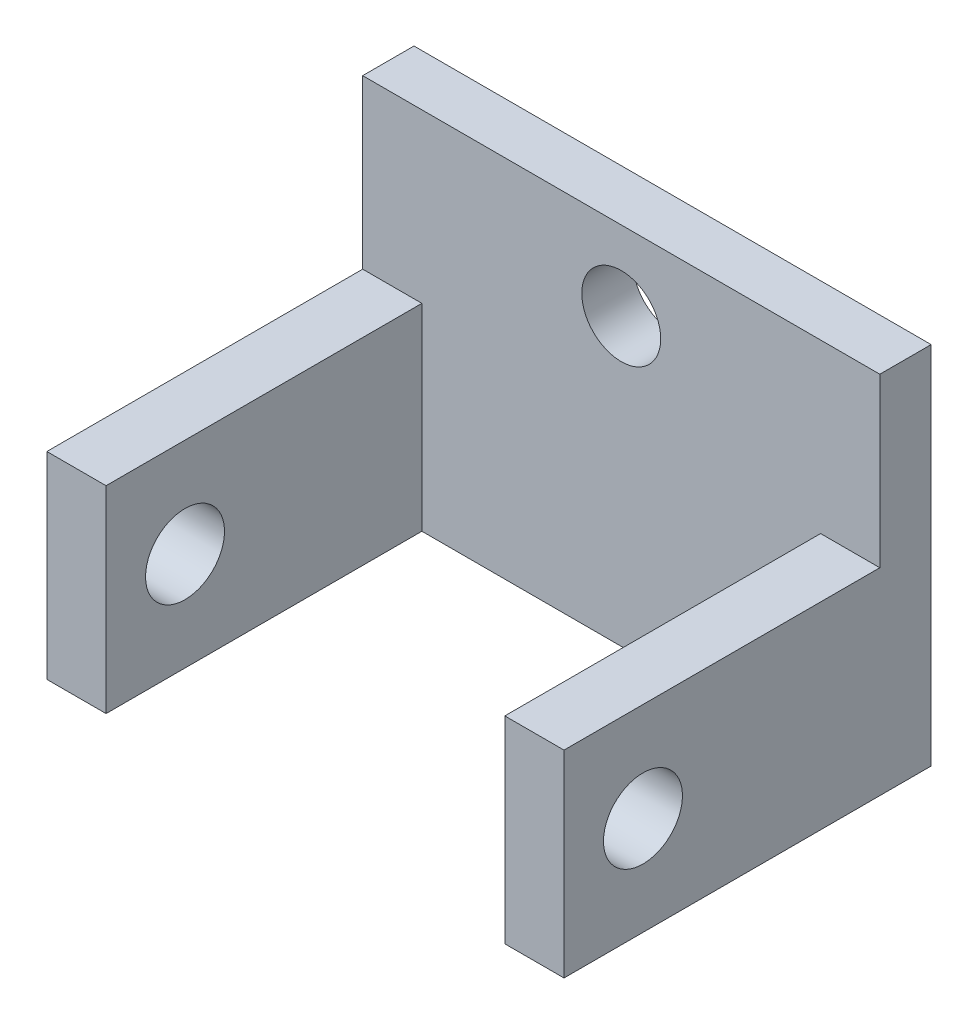
ISO-10303-21;
HEADER;
FILE_DESCRIPTION(('STEP AP214'),'2;1');
FILE_NAME('part.step','',(''),(''),'','','');
FILE_SCHEMA(('AUTOMOTIVE_DESIGN { 1 0 10303 214 1 1 1 1 }'));
ENDSEC;
DATA;
#1=APPLICATION_CONTEXT('core data for automotive mechanical design processes');
#2=APPLICATION_PROTOCOL_DEFINITION('international standard','automotive_design',2000,#1);
#3=PRODUCT_CONTEXT('',#1,'mechanical');
#4=PRODUCT('Part','Part','',(#3));
#5=PRODUCT_RELATED_PRODUCT_CATEGORY('part','',(#4));
#6=PRODUCT_DEFINITION_FORMATION('','',#4);
#7=PRODUCT_DEFINITION_CONTEXT('part definition',#1,'design');
#8=PRODUCT_DEFINITION('design','',#6,#7);
#9=PRODUCT_DEFINITION_SHAPE('','',#8);
#10=(LENGTH_UNIT() NAMED_UNIT(*) SI_UNIT(.MILLI.,.METRE.));
#11=(NAMED_UNIT(*) PLANE_ANGLE_UNIT() SI_UNIT($,.RADIAN.));
#12=(NAMED_UNIT(*) SI_UNIT($,.STERADIAN.) SOLID_ANGLE_UNIT());
#13=UNCERTAINTY_MEASURE_WITH_UNIT(LENGTH_MEASURE(1.E-05),#10,'distance_accuracy_value','');
#14=(GEOMETRIC_REPRESENTATION_CONTEXT(3) GLOBAL_UNCERTAINTY_ASSIGNED_CONTEXT((#13)) GLOBAL_UNIT_ASSIGNED_CONTEXT((#10,
#11,#12)) REPRESENTATION_CONTEXT('',''));
#15=CARTESIAN_POINT('',(0.,0.,0.));
#16=DIRECTION('',(0.,0.,1.));
#17=DIRECTION('',(1.,0.,0.));
#18=AXIS2_PLACEMENT_3D('',#15,#16,#17);
#19=CARTESIAN_POINT('',(0.,0.,1.3));
#20=DIRECTION('',(0.,0.,-1.));
#21=DIRECTION('',(-1.,0.,0.));
#22=AXIS2_PLACEMENT_3D('',#19,#20,#21);
#23=PLANE('',#22);
#24=CARTESIAN_POINT('',(6.55,7.24557974079687,1.3));
#25=DIRECTION('',(0.,0.,1.));
#26=DIRECTION('',(1.,0.,0.));
#27=AXIS2_PLACEMENT_3D('',#24,#25,#26);
#28=CIRCLE('',#27,1.);
#29=CARTESIAN_POINT('',(7.55,7.24557974079687,1.3));
#30=VERTEX_POINT('',#29);
#31=EDGE_CURVE('E183',#30,#30,#28,.T.);
#32=ORIENTED_EDGE('',*,*,#31,.F.);
#33=EDGE_LOOP('',(#32));
#34=FACE_BOUND('',#33,.T.);
#35=DIRECTION('',(-1.,0.,0.));
#36=VECTOR('',#35,1.);
#37=CARTESIAN_POINT('',(13.1,5.,1.3));
#38=LINE('',#37,#36);
#39=CARTESIAN_POINT('',(13.1,5.,1.3));
#40=VERTEX_POINT('',#39);
#41=CARTESIAN_POINT('',(11.6,5.,1.3));
#42=VERTEX_POINT('',#41);
#43=EDGE_CURVE('E256',#40,#42,#38,.T.);
#44=ORIENTED_EDGE('',*,*,#43,.F.);
#45=DIRECTION('',(0.,1.,0.));
#46=VECTOR('',#45,1.);
#47=CARTESIAN_POINT('',(13.1,0.,1.3));
#48=LINE('',#47,#46);
#49=CARTESIAN_POINT('',(13.1,9.24557974079687,1.3));
#50=VERTEX_POINT('',#49);
#51=EDGE_CURVE('E141',#40,#50,#48,.T.);
#52=ORIENTED_EDGE('',*,*,#51,.T.);
#53=DIRECTION('',(-1.,0.,0.));
#54=VECTOR('',#53,1.);
#55=CARTESIAN_POINT('',(0.,9.24557974079687,1.3));
#56=LINE('',#55,#54);
#57=CARTESIAN_POINT('',(0.,9.24557974079687,1.3));
#58=VERTEX_POINT('',#57);
#59=EDGE_CURVE('E199',#50,#58,#56,.T.);
#60=ORIENTED_EDGE('',*,*,#59,.T.);
#61=DIRECTION('',(0.,-1.,0.));
#62=VECTOR('',#61,1.);
#63=CARTESIAN_POINT('',(0.,0.,1.3));
#64=LINE('',#63,#62);
#65=CARTESIAN_POINT('',(0.,5.,1.3));
#66=VERTEX_POINT('',#65);
#67=EDGE_CURVE('E191',#58,#66,#64,.T.);
#68=ORIENTED_EDGE('',*,*,#67,.T.);
#69=DIRECTION('',(-1.,0.,0.));
#70=VECTOR('',#69,1.);
#71=CARTESIAN_POINT('',(0.,5.,1.3));
#72=LINE('',#71,#70);
#73=CARTESIAN_POINT('',(1.5,5.,1.3));
#74=VERTEX_POINT('',#73);
#75=EDGE_CURVE('E148',#74,#66,#72,.T.);
#76=ORIENTED_EDGE('',*,*,#75,.F.);
#77=DIRECTION('',(0.,1.,0.));
#78=VECTOR('',#77,1.);
#79=CARTESIAN_POINT('',(1.5,5.,1.3));
#80=LINE('',#79,#78);
#81=CARTESIAN_POINT('',(1.5,0.,1.3));
#82=VERTEX_POINT('',#81);
#83=EDGE_CURVE('E143',#82,#74,#80,.T.);
#84=ORIENTED_EDGE('',*,*,#83,.F.);
#85=DIRECTION('',(1.,0.,0.));
#86=VECTOR('',#85,1.);
#87=CARTESIAN_POINT('',(0.,0.,1.3));
#88=LINE('',#87,#86);
#89=CARTESIAN_POINT('',(11.6,0.,1.3));
#90=VERTEX_POINT('',#89);
#91=EDGE_CURVE('E61',#82,#90,#88,.T.);
#92=ORIENTED_EDGE('',*,*,#91,.T.);
#93=DIRECTION('',(0.,-1.,0.));
#94=VECTOR('',#93,1.);
#95=CARTESIAN_POINT('',(11.6,5.,1.3));
#96=LINE('',#95,#94);
#97=EDGE_CURVE('E56',#42,#90,#96,.T.);
#98=ORIENTED_EDGE('',*,*,#97,.F.);
#99=EDGE_LOOP('',(#44,#52,#60,#68,#76,#84,#92,#98));
#100=FACE_BOUND('',#99,.T.);
#101=ADVANCED_FACE('F39',(#34,#100),#23,.F.);
#102=CARTESIAN_POINT('',(0.,0.,0.));
#103=DIRECTION('',(0.,0.,-1.));
#104=DIRECTION('',(-1.,0.,0.));
#105=AXIS2_PLACEMENT_3D('',#102,#103,#104);
#106=PLANE('',#105);
#107=DIRECTION('',(0.,-1.,0.));
#108=VECTOR('',#107,1.);
#109=CARTESIAN_POINT('',(0.,0.,0.));
#110=LINE('',#109,#108);
#111=CARTESIAN_POINT('',(0.,9.24557974079687,0.));
#112=VERTEX_POINT('',#111);
#113=CARTESIAN_POINT('',(0.,0.,0.));
#114=VERTEX_POINT('',#113);
#115=EDGE_CURVE('E187',#112,#114,#110,.T.);
#116=ORIENTED_EDGE('',*,*,#115,.F.);
#117=DIRECTION('',(-1.,0.,0.));
#118=VECTOR('',#117,1.);
#119=CARTESIAN_POINT('',(0.,9.24557974079687,0.));
#120=LINE('',#119,#118);
#121=CARTESIAN_POINT('',(13.1,9.24557974079687,0.));
#122=VERTEX_POINT('',#121);
#123=EDGE_CURVE('E194',#122,#112,#120,.T.);
#124=ORIENTED_EDGE('',*,*,#123,.F.);
#125=DIRECTION('',(0.,1.,0.));
#126=VECTOR('',#125,1.);
#127=CARTESIAN_POINT('',(13.1,0.,0.));
#128=LINE('',#127,#126);
#129=CARTESIAN_POINT('',(13.1,0.,0.));
#130=VERTEX_POINT('',#129);
#131=EDGE_CURVE('E209',#130,#122,#128,.T.);
#132=ORIENTED_EDGE('',*,*,#131,.F.);
#133=DIRECTION('',(1.,0.,0.));
#134=VECTOR('',#133,1.);
#135=CARTESIAN_POINT('',(0.,0.,0.));
#136=LINE('',#135,#134);
#137=EDGE_CURVE('E206',#114,#130,#136,.T.);
#138=ORIENTED_EDGE('',*,*,#137,.F.);
#139=EDGE_LOOP('',(#116,#124,#132,#138));
#140=FACE_BOUND('',#139,.T.);
#141=CARTESIAN_POINT('',(6.55,7.24557974079687,0.));
#142=DIRECTION('',(0.,0.,1.));
#143=DIRECTION('',(1.,0.,0.));
#144=AXIS2_PLACEMENT_3D('',#141,#142,#143);
#145=CIRCLE('',#144,1.);
#146=CARTESIAN_POINT('',(7.55,7.24557974079687,0.));
#147=VERTEX_POINT('',#146);
#148=EDGE_CURVE('E182',#147,#147,#145,.T.);
#149=ORIENTED_EDGE('',*,*,#148,.T.);
#150=EDGE_LOOP('',(#149));
#151=FACE_BOUND('',#150,.T.);
#152=ADVANCED_FACE('F227',(#140,#151),#106,.T.);
#153=CARTESIAN_POINT('',(0.,0.,1.3));
#154=DIRECTION('',(1.,0.,0.));
#155=DIRECTION('',(0.,0.,-1.));
#156=AXIS2_PLACEMENT_3D('',#153,#154,#155);
#157=PLANE('',#156);
#158=CARTESIAN_POINT('',(0.,2.5,7.3));
#159=DIRECTION('',(-1.,0.,0.));
#160=DIRECTION('',(0.,0.,1.));
#161=AXIS2_PLACEMENT_3D('',#158,#159,#160);
#162=CIRCLE('',#161,1.);
#163=CARTESIAN_POINT('',(0.,2.5,8.3));
#164=VERTEX_POINT('',#163);
#165=EDGE_CURVE('E269',#164,#164,#162,.T.);
#166=ORIENTED_EDGE('',*,*,#165,.F.);
#167=EDGE_LOOP('',(#166));
#168=FACE_BOUND('',#167,.T.);
#169=ORIENTED_EDGE('',*,*,#115,.T.);
#170=DIRECTION('',(0.,0.,-1.));
#171=VECTOR('',#170,1.);
#172=CARTESIAN_POINT('',(0.,0.,1.3));
#173=LINE('',#172,#171);
#174=CARTESIAN_POINT('',(0.,0.,9.3));
#175=VERTEX_POINT('',#174);
#176=EDGE_CURVE('E11',#175,#114,#173,.T.);
#177=ORIENTED_EDGE('',*,*,#176,.F.);
#178=DIRECTION('',(0.,-1.,0.));
#179=VECTOR('',#178,1.);
#180=CARTESIAN_POINT('',(0.,5.,9.3));
#181=LINE('',#180,#179);
#182=CARTESIAN_POINT('',(0.,5.,9.3));
#183=VERTEX_POINT('',#182);
#184=EDGE_CURVE('E154',#183,#175,#181,.T.);
#185=ORIENTED_EDGE('',*,*,#184,.F.);
#186=DIRECTION('',(0.,0.,-1.));
#187=VECTOR('',#186,1.);
#188=CARTESIAN_POINT('',(0.,5.,9.3));
#189=LINE('',#188,#187);
#190=EDGE_CURVE('E166',#183,#66,#189,.T.);
#191=ORIENTED_EDGE('',*,*,#190,.T.);
#192=ORIENTED_EDGE('',*,*,#67,.F.);
#193=DIRECTION('',(0.,0.,-1.));
#194=VECTOR('',#193,1.);
#195=CARTESIAN_POINT('',(0.,9.24557974079687,1.3));
#196=LINE('',#195,#194);
#197=EDGE_CURVE('E202',#58,#112,#196,.T.);
#198=ORIENTED_EDGE('',*,*,#197,.T.);
#199=EDGE_LOOP('',(#169,#177,#185,#191,#192,#198));
#200=FACE_BOUND('',#199,.T.);
#201=ADVANCED_FACE('F41',(#168,#200),#157,.F.);
#202=CARTESIAN_POINT('',(0.,0.,1.3));
#203=DIRECTION('',(0.,1.,0.));
#204=DIRECTION('',(0.,0.,1.));
#205=AXIS2_PLACEMENT_3D('',#202,#203,#204);
#206=PLANE('',#205);
#207=ORIENTED_EDGE('',*,*,#137,.T.);
#208=DIRECTION('',(0.,0.,-1.));
#209=VECTOR('',#208,1.);
#210=CARTESIAN_POINT('',(13.1,0.,1.3));
#211=LINE('',#210,#209);
#212=CARTESIAN_POINT('',(13.1,0.,9.3));
#213=VERTEX_POINT('',#212);
#214=EDGE_CURVE('E49',#213,#130,#211,.T.);
#215=ORIENTED_EDGE('',*,*,#214,.F.);
#216=DIRECTION('',(1.,0.,0.));
#217=VECTOR('',#216,1.);
#218=CARTESIAN_POINT('',(13.1,0.,9.3));
#219=LINE('',#218,#217);
#220=CARTESIAN_POINT('',(11.6,0.,9.3));
#221=VERTEX_POINT('',#220);
#222=EDGE_CURVE('E134',#221,#213,#219,.T.);
#223=ORIENTED_EDGE('',*,*,#222,.F.);
#224=DIRECTION('',(0.,0.,-1.));
#225=VECTOR('',#224,1.);
#226=CARTESIAN_POINT('',(11.6,0.,9.3));
#227=LINE('',#226,#225);
#228=EDGE_CURVE('E150',#221,#90,#227,.T.);
#229=ORIENTED_EDGE('',*,*,#228,.T.);
#230=ORIENTED_EDGE('',*,*,#91,.F.);
#231=DIRECTION('',(0.,0.,-1.));
#232=VECTOR('',#231,1.);
#233=CARTESIAN_POINT('',(1.5,0.,9.3));
#234=LINE('',#233,#232);
#235=CARTESIAN_POINT('',(1.5,0.,9.3));
#236=VERTEX_POINT('',#235);
#237=EDGE_CURVE('E178',#236,#82,#234,.T.);
#238=ORIENTED_EDGE('',*,*,#237,.F.);
#239=DIRECTION('',(1.,0.,0.));
#240=VECTOR('',#239,1.);
#241=CARTESIAN_POINT('',(0.,0.,9.3));
#242=LINE('',#241,#240);
#243=EDGE_CURVE('E158',#175,#236,#242,.T.);
#244=ORIENTED_EDGE('',*,*,#243,.F.);
#245=ORIENTED_EDGE('',*,*,#176,.T.);
#246=EDGE_LOOP('',(#207,#215,#223,#229,#230,#238,#244,#245));
#247=FACE_BOUND('',#246,.T.);
#248=ADVANCED_FACE('F246',(#247),#206,.F.);
#249=CARTESIAN_POINT('',(13.1,0.,1.3));
#250=DIRECTION('',(-1.,0.,0.));
#251=DIRECTION('',(0.,0.,1.));
#252=AXIS2_PLACEMENT_3D('',#249,#250,#251);
#253=PLANE('',#252);
#254=CARTESIAN_POINT('',(13.1,2.5,7.3));
#255=DIRECTION('',(-1.,0.,0.));
#256=DIRECTION('',(0.,0.,1.));
#257=AXIS2_PLACEMENT_3D('',#254,#255,#256);
#258=CIRCLE('',#257,1.);
#259=CARTESIAN_POINT('',(13.1,2.5,8.3));
#260=VERTEX_POINT('',#259);
#261=EDGE_CURVE('E258',#260,#260,#258,.T.);
#262=ORIENTED_EDGE('',*,*,#261,.T.);
#263=EDGE_LOOP('',(#262));
#264=FACE_BOUND('',#263,.T.);
#265=ORIENTED_EDGE('',*,*,#131,.T.);
#266=DIRECTION('',(0.,0.,-1.));
#267=VECTOR('',#266,1.);
#268=CARTESIAN_POINT('',(13.1,9.24557974079687,1.3));
#269=LINE('',#268,#267);
#270=EDGE_CURVE('E217',#50,#122,#269,.T.);
#271=ORIENTED_EDGE('',*,*,#270,.F.);
#272=ORIENTED_EDGE('',*,*,#51,.F.);
#273=DIRECTION('',(0.,0.,-1.));
#274=VECTOR('',#273,1.);
#275=CARTESIAN_POINT('',(13.1,5.,9.3));
#276=LINE('',#275,#274);
#277=CARTESIAN_POINT('',(13.1,5.,9.3));
#278=VERTEX_POINT('',#277);
#279=EDGE_CURVE('E121',#278,#40,#276,.T.);
#280=ORIENTED_EDGE('',*,*,#279,.F.);
#281=DIRECTION('',(0.,1.,0.));
#282=VECTOR('',#281,1.);
#283=CARTESIAN_POINT('',(13.1,5.,9.3));
#284=LINE('',#283,#282);
#285=EDGE_CURVE('E128',#213,#278,#284,.T.);
#286=ORIENTED_EDGE('',*,*,#285,.F.);
#287=ORIENTED_EDGE('',*,*,#214,.T.);
#288=EDGE_LOOP('',(#265,#271,#272,#280,#286,#287));
#289=FACE_BOUND('',#288,.T.);
#290=ADVANCED_FACE('F139',(#264,#289),#253,.F.);
#291=CARTESIAN_POINT('',(0.,9.24557974079687,1.3));
#292=DIRECTION('',(0.,-1.,0.));
#293=DIRECTION('',(0.,0.,-1.));
#294=AXIS2_PLACEMENT_3D('',#291,#292,#293);
#295=PLANE('',#294);
#296=ORIENTED_EDGE('',*,*,#123,.T.);
#297=ORIENTED_EDGE('',*,*,#197,.F.);
#298=ORIENTED_EDGE('',*,*,#59,.F.);
#299=ORIENTED_EDGE('',*,*,#270,.T.);
#300=EDGE_LOOP('',(#296,#297,#298,#299));
#301=FACE_BOUND('',#300,.T.);
#302=ADVANCED_FACE('F231',(#301),#295,.F.);
#303=CARTESIAN_POINT('',(6.55,7.24557974079687,1.3));
#304=DIRECTION('',(0.,0.,-1.));
#305=DIRECTION('',(-1.,0.,0.));
#306=AXIS2_PLACEMENT_3D('',#303,#304,#305);
#307=CYLINDRICAL_SURFACE('',#306,1.);
#308=ORIENTED_EDGE('',*,*,#31,.T.);
#309=EDGE_LOOP('',(#308));
#310=FACE_BOUND('',#309,.T.);
#311=ORIENTED_EDGE('',*,*,#148,.F.);
#312=EDGE_LOOP('',(#311));
#313=FACE_BOUND('',#312,.T.);
#314=ADVANCED_FACE('F293',(#310,#313),#307,.F.);
#315=CARTESIAN_POINT('',(1.5,5.,9.3));
#316=DIRECTION('',(-1.,0.,0.));
#317=DIRECTION('',(0.,-1.,0.));
#318=AXIS2_PLACEMENT_3D('',#315,#316,#317);
#319=PLANE('',#318);
#320=CARTESIAN_POINT('',(1.5,2.5,7.3));
#321=DIRECTION('',(-1.,0.,0.));
#322=DIRECTION('',(0.,-1.,0.));
#323=AXIS2_PLACEMENT_3D('',#320,#321,#322);
#324=CIRCLE('',#323,1.);
#325=CARTESIAN_POINT('',(1.5,1.5,7.3));
#326=VERTEX_POINT('',#325);
#327=EDGE_CURVE('E265',#326,#326,#324,.T.);
#328=ORIENTED_EDGE('',*,*,#327,.T.);
#329=EDGE_LOOP('',(#328));
#330=FACE_BOUND('',#329,.T.);
#331=ORIENTED_EDGE('',*,*,#83,.T.);
#332=DIRECTION('',(0.,0.,-1.));
#333=VECTOR('',#332,1.);
#334=CARTESIAN_POINT('',(1.5,5.,9.3));
#335=LINE('',#334,#333);
#336=CARTESIAN_POINT('',(1.5,5.,9.3));
#337=VERTEX_POINT('',#336);
#338=EDGE_CURVE('E174',#337,#74,#335,.T.);
#339=ORIENTED_EDGE('',*,*,#338,.F.);
#340=DIRECTION('',(0.,1.,0.));
#341=VECTOR('',#340,1.);
#342=CARTESIAN_POINT('',(1.5,5.,9.3));
#343=LINE('',#342,#341);
#344=EDGE_CURVE('E161',#236,#337,#343,.T.);
#345=ORIENTED_EDGE('',*,*,#344,.F.);
#346=ORIENTED_EDGE('',*,*,#237,.T.);
#347=EDGE_LOOP('',(#331,#339,#345,#346));
#348=FACE_BOUND('',#347,.T.);
#349=ADVANCED_FACE('F243',(#330,#348),#319,.F.);
#350=CARTESIAN_POINT('',(0.,5.,9.3));
#351=DIRECTION('',(0.,-1.,0.));
#352=DIRECTION('',(0.,0.,-1.));
#353=AXIS2_PLACEMENT_3D('',#350,#351,#352);
#354=PLANE('',#353);
#355=ORIENTED_EDGE('',*,*,#75,.T.);
#356=ORIENTED_EDGE('',*,*,#190,.F.);
#357=DIRECTION('',(-1.,0.,0.));
#358=VECTOR('',#357,1.);
#359=CARTESIAN_POINT('',(0.,5.,9.3));
#360=LINE('',#359,#358);
#361=EDGE_CURVE('E164',#337,#183,#360,.T.);
#362=ORIENTED_EDGE('',*,*,#361,.F.);
#363=ORIENTED_EDGE('',*,*,#338,.T.);
#364=EDGE_LOOP('',(#355,#356,#362,#363));
#365=FACE_BOUND('',#364,.T.);
#366=ADVANCED_FACE('F238',(#365),#354,.F.);
#367=CARTESIAN_POINT('',(0.,0.,9.3));
#368=DIRECTION('',(0.,0.,1.));
#369=DIRECTION('',(1.,0.,0.));
#370=AXIS2_PLACEMENT_3D('',#367,#368,#369);
#371=PLANE('',#370);
#372=ORIENTED_EDGE('',*,*,#184,.T.);
#373=ORIENTED_EDGE('',*,*,#243,.T.);
#374=ORIENTED_EDGE('',*,*,#344,.T.);
#375=ORIENTED_EDGE('',*,*,#361,.T.);
#376=EDGE_LOOP('',(#372,#373,#374,#375));
#377=FACE_BOUND('',#376,.T.);
#378=ADVANCED_FACE('F312',(#377),#371,.T.);
#379=CARTESIAN_POINT('',(13.1,5.,9.3));
#380=DIRECTION('',(0.,-1.,0.));
#381=DIRECTION('',(0.,0.,-1.));
#382=AXIS2_PLACEMENT_3D('',#379,#380,#381);
#383=PLANE('',#382);
#384=ORIENTED_EDGE('',*,*,#43,.T.);
#385=DIRECTION('',(0.,0.,-1.));
#386=VECTOR('',#385,1.);
#387=CARTESIAN_POINT('',(11.6,5.,9.3));
#388=LINE('',#387,#386);
#389=CARTESIAN_POINT('',(11.6,5.,9.3));
#390=VERTEX_POINT('',#389);
#391=EDGE_CURVE('E123',#390,#42,#388,.T.);
#392=ORIENTED_EDGE('',*,*,#391,.F.);
#393=DIRECTION('',(-1.,0.,0.));
#394=VECTOR('',#393,1.);
#395=CARTESIAN_POINT('',(13.1,5.,9.3));
#396=LINE('',#395,#394);
#397=EDGE_CURVE('E117',#278,#390,#396,.T.);
#398=ORIENTED_EDGE('',*,*,#397,.F.);
#399=ORIENTED_EDGE('',*,*,#279,.T.);
#400=EDGE_LOOP('',(#384,#392,#398,#399));
#401=FACE_BOUND('',#400,.T.);
#402=ADVANCED_FACE('F119',(#401),#383,.F.);
#403=CARTESIAN_POINT('',(11.6,5.,9.3));
#404=DIRECTION('',(1.,0.,0.));
#405=DIRECTION('',(0.,0.,-1.));
#406=AXIS2_PLACEMENT_3D('',#403,#404,#405);
#407=PLANE('',#406);
#408=CARTESIAN_POINT('',(11.6,2.5,7.3));
#409=DIRECTION('',(1.,0.,0.));
#410=DIRECTION('',(0.,0.,-1.));
#411=AXIS2_PLACEMENT_3D('',#408,#409,#410);
#412=CIRCLE('',#411,1.);
#413=CARTESIAN_POINT('',(11.6,2.5,6.3));
#414=VERTEX_POINT('',#413);
#415=EDGE_CURVE('E43',#414,#414,#412,.T.);
#416=ORIENTED_EDGE('',*,*,#415,.T.);
#417=EDGE_LOOP('',(#416));
#418=FACE_BOUND('',#417,.T.);
#419=ORIENTED_EDGE('',*,*,#97,.T.);
#420=ORIENTED_EDGE('',*,*,#228,.F.);
#421=DIRECTION('',(0.,-1.,0.));
#422=VECTOR('',#421,1.);
#423=CARTESIAN_POINT('',(11.6,5.,9.3));
#424=LINE('',#423,#422);
#425=EDGE_CURVE('E127',#390,#221,#424,.T.);
#426=ORIENTED_EDGE('',*,*,#425,.F.);
#427=ORIENTED_EDGE('',*,*,#391,.T.);
#428=EDGE_LOOP('',(#419,#420,#426,#427));
#429=FACE_BOUND('',#428,.T.);
#430=ADVANCED_FACE('F278',(#418,#429),#407,.F.);
#431=CARTESIAN_POINT('',(0.,0.,9.3));
#432=DIRECTION('',(0.,0.,-1.));
#433=DIRECTION('',(-1.,0.,0.));
#434=AXIS2_PLACEMENT_3D('',#431,#432,#433);
#435=PLANE('',#434);
#436=ORIENTED_EDGE('',*,*,#285,.T.);
#437=ORIENTED_EDGE('',*,*,#397,.T.);
#438=ORIENTED_EDGE('',*,*,#425,.T.);
#439=ORIENTED_EDGE('',*,*,#222,.T.);
#440=EDGE_LOOP('',(#436,#437,#438,#439));
#441=FACE_BOUND('',#440,.T.);
#442=ADVANCED_FACE('F132',(#441),#435,.F.);
#443=CARTESIAN_POINT('',(15.,2.5,7.3));
#444=DIRECTION('',(-1.,0.,0.));
#445=DIRECTION('',(0.,0.,1.));
#446=AXIS2_PLACEMENT_3D('',#443,#444,#445);
#447=CYLINDRICAL_SURFACE('',#446,1.);
#448=ORIENTED_EDGE('',*,*,#415,.F.);
#449=EDGE_LOOP('',(#448));
#450=FACE_BOUND('',#449,.T.);
#451=ORIENTED_EDGE('',*,*,#261,.F.);
#452=EDGE_LOOP('',(#451));
#453=FACE_BOUND('',#452,.T.);
#454=ADVANCED_FACE('F280',(#450,#453),#447,.F.);
#455=ORIENTED_EDGE('',*,*,#165,.T.);
#456=EDGE_LOOP('',(#455));
#457=FACE_BOUND('',#456,.T.);
#458=ORIENTED_EDGE('',*,*,#327,.F.);
#459=EDGE_LOOP('',(#458));
#460=FACE_BOUND('',#459,.T.);
#461=ADVANCED_FACE('F283',(#457,#460),#447,.F.);
#462=CLOSED_SHELL('',(#101,#152,#201,#248,#290,#302,#314,#349,#366,#378,#402,#430,#442,#454,#461));
#463=MANIFOLD_SOLID_BREP('B2',#462);
#464=ADVANCED_BREP_SHAPE_REPRESENTATION('',(#18,#463),#14);
#465=SHAPE_DEFINITION_REPRESENTATION(#9,#464);
ENDSEC;
END-ISO-10303-21;
